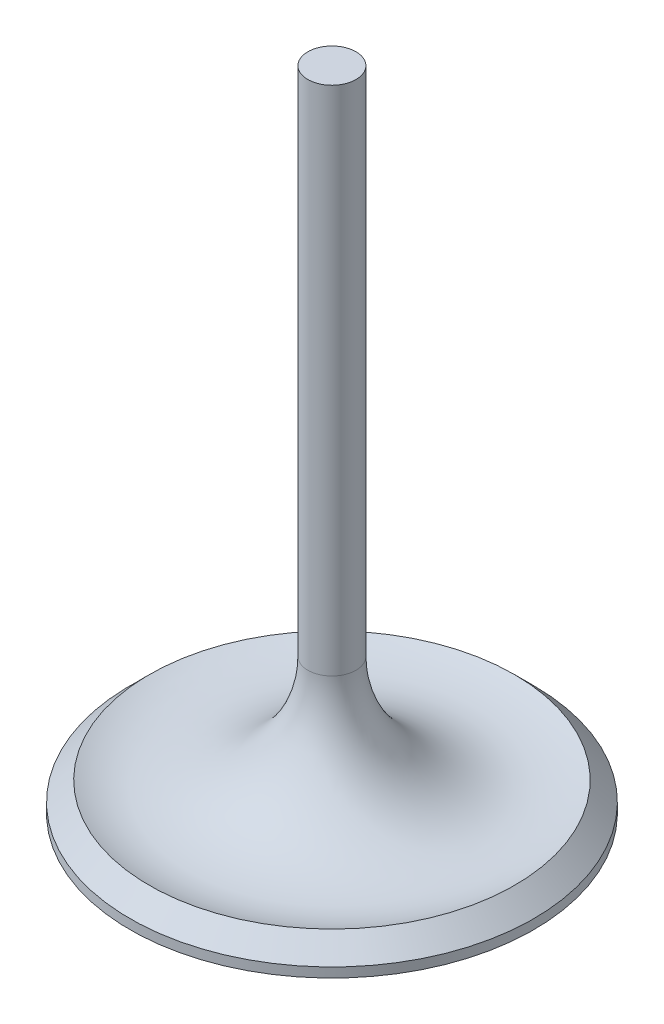
ISO-10303-21;
HEADER;
FILE_DESCRIPTION(('STEP AP214'),'2;1');
FILE_NAME('part.step','',(''),(''),'','','');
FILE_SCHEMA(('AUTOMOTIVE_DESIGN { 1 0 10303 214 1 1 1 1 }'));
ENDSEC;
DATA;
#1=APPLICATION_CONTEXT('core data for automotive mechanical design processes');
#2=APPLICATION_PROTOCOL_DEFINITION('international standard','automotive_design',2000,#1);
#3=PRODUCT_CONTEXT('',#1,'mechanical');
#4=PRODUCT('Part','Part','',(#3));
#5=PRODUCT_RELATED_PRODUCT_CATEGORY('part','',(#4));
#6=PRODUCT_DEFINITION_FORMATION('','',#4);
#7=PRODUCT_DEFINITION_CONTEXT('part definition',#1,'design');
#8=PRODUCT_DEFINITION('design','',#6,#7);
#9=PRODUCT_DEFINITION_SHAPE('','',#8);
#10=(LENGTH_UNIT() NAMED_UNIT(*) SI_UNIT(.MILLI.,.METRE.));
#11=(NAMED_UNIT(*) PLANE_ANGLE_UNIT() SI_UNIT($,.RADIAN.));
#12=(NAMED_UNIT(*) SI_UNIT($,.STERADIAN.) SOLID_ANGLE_UNIT());
#13=UNCERTAINTY_MEASURE_WITH_UNIT(LENGTH_MEASURE(1.E-05),#10,'distance_accuracy_value','');
#14=(GEOMETRIC_REPRESENTATION_CONTEXT(3) GLOBAL_UNCERTAINTY_ASSIGNED_CONTEXT((#13)) GLOBAL_UNIT_ASSIGNED_CONTEXT((#10,
#11,#12)) REPRESENTATION_CONTEXT('',''));
#15=CARTESIAN_POINT('',(0.,0.,0.));
#16=DIRECTION('',(0.,0.,1.));
#17=DIRECTION('',(1.,0.,0.));
#18=AXIS2_PLACEMENT_3D('',#15,#16,#17);
#19=CARTESIAN_POINT('',(0.,0.,0.));
#20=DIRECTION('',(0.,-1.,0.));
#21=DIRECTION('',(0.,0.,-1.));
#22=AXIS2_PLACEMENT_3D('',#19,#20,#21);
#23=PLANE('',#22);
#24=CARTESIAN_POINT('',(0.,0.,0.));
#25=DIRECTION('',(0.,-1.,0.));
#26=DIRECTION('',(0.,0.,-1.));
#27=AXIS2_PLACEMENT_3D('',#24,#25,#26);
#28=CIRCLE('',#27,26.67);
#29=CARTESIAN_POINT('',(0.,0.,-26.67));
#30=VERTEX_POINT('',#29);
#31=EDGE_CURVE('E10',#30,#30,#28,.T.);
#32=ORIENTED_EDGE('',*,*,#31,.T.);
#33=EDGE_LOOP('',(#32));
#34=FACE_BOUND('',#33,.T.);
#35=ADVANCED_FACE('F43',(#34),#23,.T.);
#36=CARTESIAN_POINT('',(0.,0.,0.));
#37=DIRECTION('',(0.,-1.,0.));
#38=DIRECTION('',(0.,0.,-1.));
#39=AXIS2_PLACEMENT_3D('',#36,#37,#38);
#40=CYLINDRICAL_SURFACE('',#39,26.67);
#41=CARTESIAN_POINT('',(0.,1.27,0.));
#42=DIRECTION('',(0.,-1.,0.));
#43=DIRECTION('',(0.,0.,-1.));
#44=AXIS2_PLACEMENT_3D('',#41,#42,#43);
#45=CIRCLE('',#44,26.67);
#46=CARTESIAN_POINT('',(0.,1.27,-26.67));
#47=VERTEX_POINT('',#46);
#48=EDGE_CURVE('E50',#47,#47,#45,.T.);
#49=ORIENTED_EDGE('',*,*,#48,.T.);
#50=EDGE_LOOP('',(#49));
#51=FACE_BOUND('',#50,.T.);
#52=ORIENTED_EDGE('',*,*,#31,.F.);
#53=EDGE_LOOP('',(#52));
#54=FACE_BOUND('',#53,.T.);
#55=ADVANCED_FACE('F83',(#51,#54),#40,.T.);
#56=CARTESIAN_POINT('',(0.,1.27,0.));
#57=DIRECTION('',(0.,-1.,0.));
#58=DIRECTION('',(0.,0.,-1.));
#59=AXIS2_PLACEMENT_3D('',#56,#57,#58);
#60=CONICAL_SURFACE('',#59,26.67,0.785398163397447);
#61=CARTESIAN_POINT('',(0.,3.81,0.));
#62=DIRECTION('',(0.,-1.,0.));
#63=DIRECTION('',(0.,0.,-1.));
#64=AXIS2_PLACEMENT_3D('',#61,#62,#63);
#65=CIRCLE('',#64,24.13);
#66=CARTESIAN_POINT('',(0.,3.81,-24.13));
#67=VERTEX_POINT('',#66);
#68=EDGE_CURVE('E55',#67,#67,#65,.T.);
#69=ORIENTED_EDGE('',*,*,#68,.T.);
#70=EDGE_LOOP('',(#69));
#71=FACE_BOUND('',#70,.T.);
#72=ORIENTED_EDGE('',*,*,#48,.F.);
#73=EDGE_LOOP('',(#72));
#74=FACE_BOUND('',#73,.T.);
#75=ADVANCED_FACE('F87',(#71,#74),#60,.T.);
#76=CARTESIAN_POINT('',(0.,17.9546986535592,0.));
#77=DIRECTION('',(0.,-1.,0.));
#78=DIRECTION('',(0.,0.,-1.));
#79=AXIS2_PLACEMENT_3D('',#76,#77,#78);
#80=TOROIDAL_SURFACE('',#79,18.43,15.25);
#81=CARTESIAN_POINT('',(0.,17.9546986535592,0.));
#82=DIRECTION('',(0.,-1.,0.));
#83=DIRECTION('',(0.,0.,-1.));
#84=AXIS2_PLACEMENT_3D('',#81,#82,#83);
#85=CIRCLE('',#84,3.18000000000001);
#86=CARTESIAN_POINT('',(0.,17.9546986535592,-3.18000000000001));
#87=VERTEX_POINT('',#86);
#88=EDGE_CURVE('E60',#87,#87,#85,.T.);
#89=ORIENTED_EDGE('',*,*,#88,.T.);
#90=EDGE_LOOP('',(#89));
#91=FACE_BOUND('',#90,.T.);
#92=ORIENTED_EDGE('',*,*,#68,.F.);
#93=EDGE_LOOP('',(#92));
#94=FACE_BOUND('',#93,.T.);
#95=ADVANCED_FACE('F80',(#91,#94),#80,.F.);
#96=CARTESIAN_POINT('',(0.,0.,0.));
#97=DIRECTION('',(0.,-1.,0.));
#98=DIRECTION('',(0.,0.,-1.));
#99=AXIS2_PLACEMENT_3D('',#96,#97,#98);
#100=CYLINDRICAL_SURFACE('',#99,3.18000000000001);
#101=CARTESIAN_POINT('',(0.,85.55,0.));
#102=DIRECTION('',(0.,-1.,0.));
#103=DIRECTION('',(0.,0.,-1.));
#104=AXIS2_PLACEMENT_3D('',#101,#102,#103);
#105=CIRCLE('',#104,3.18);
#106=CARTESIAN_POINT('',(0.,85.55,-3.18));
#107=VERTEX_POINT('',#106);
#108=EDGE_CURVE('E66',#107,#107,#105,.T.);
#109=ORIENTED_EDGE('',*,*,#108,.T.);
#110=EDGE_LOOP('',(#109));
#111=FACE_BOUND('',#110,.T.);
#112=ORIENTED_EDGE('',*,*,#88,.F.);
#113=EDGE_LOOP('',(#112));
#114=FACE_BOUND('',#113,.T.);
#115=ADVANCED_FACE('F71',(#111,#114),#100,.T.);
#116=CARTESIAN_POINT('',(0.,85.55,0.));
#117=DIRECTION('',(0.,1.,0.));
#118=DIRECTION('',(0.,0.,1.));
#119=AXIS2_PLACEMENT_3D('',#116,#117,#118);
#120=PLANE('',#119);
#121=ORIENTED_EDGE('',*,*,#108,.F.);
#122=EDGE_LOOP('',(#121));
#123=FACE_BOUND('',#122,.T.);
#124=ADVANCED_FACE('F74',(#123),#120,.T.);
#125=CLOSED_SHELL('',(#35,#55,#75,#95,#115,#124));
#126=MANIFOLD_SOLID_BREP('B2',#125);
#127=ADVANCED_BREP_SHAPE_REPRESENTATION('',(#18,#126),#14);
#128=SHAPE_DEFINITION_REPRESENTATION(#9,#127);
ENDSEC;
END-ISO-10303-21;
